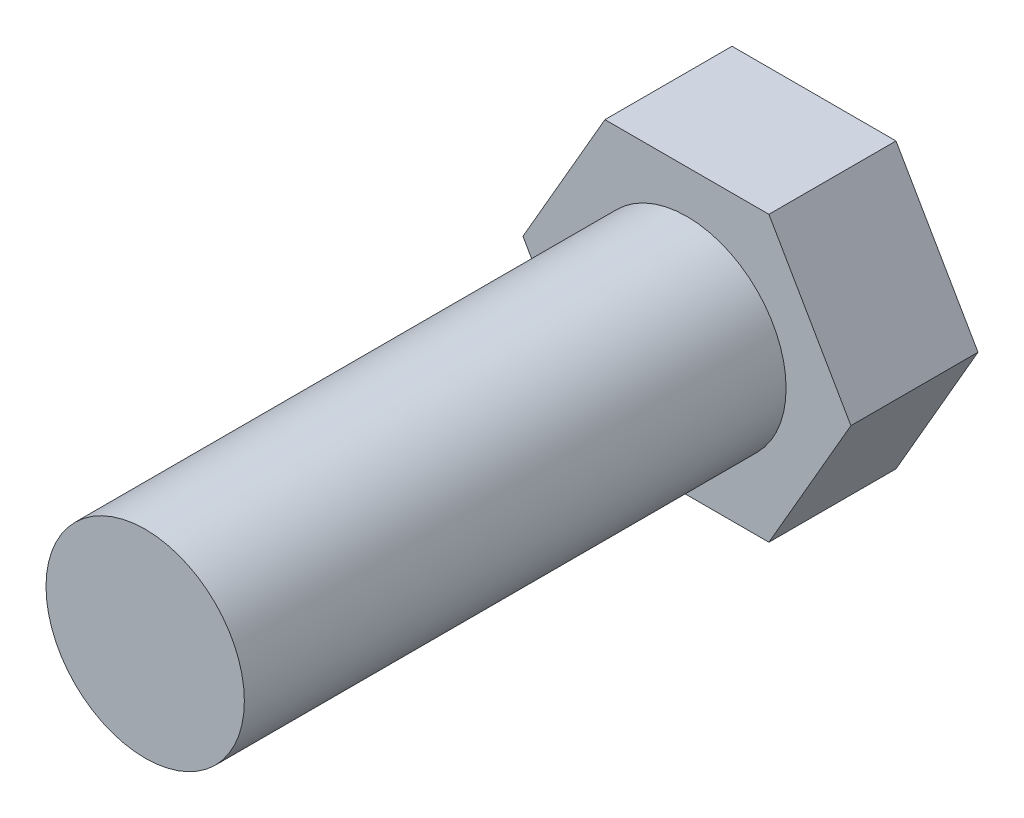
ISO-10303-21;
HEADER;
FILE_DESCRIPTION(('STEP AP214'),'2;1');
FILE_NAME('part.step','',(''),(''),'','','');
FILE_SCHEMA(('AUTOMOTIVE_DESIGN { 1 0 10303 214 1 1 1 1 }'));
ENDSEC;
DATA;
#1=APPLICATION_CONTEXT('core data for automotive mechanical design processes');
#2=APPLICATION_PROTOCOL_DEFINITION('international standard','automotive_design',2000,#1);
#3=PRODUCT_CONTEXT('',#1,'mechanical');
#4=PRODUCT('Part','Part','',(#3));
#5=PRODUCT_RELATED_PRODUCT_CATEGORY('part','',(#4));
#6=PRODUCT_DEFINITION_FORMATION('','',#4);
#7=PRODUCT_DEFINITION_CONTEXT('part definition',#1,'design');
#8=PRODUCT_DEFINITION('design','',#6,#7);
#9=PRODUCT_DEFINITION_SHAPE('','',#8);
#10=(LENGTH_UNIT() NAMED_UNIT(*) SI_UNIT(.MILLI.,.METRE.));
#11=(NAMED_UNIT(*) PLANE_ANGLE_UNIT() SI_UNIT($,.RADIAN.));
#12=(NAMED_UNIT(*) SI_UNIT($,.STERADIAN.) SOLID_ANGLE_UNIT());
#13=UNCERTAINTY_MEASURE_WITH_UNIT(LENGTH_MEASURE(1.E-05),#10,'distance_accuracy_value','');
#14=(GEOMETRIC_REPRESENTATION_CONTEXT(3) GLOBAL_UNCERTAINTY_ASSIGNED_CONTEXT((#13)) GLOBAL_UNIT_ASSIGNED_CONTEXT((#10,
#11,#12)) REPRESENTATION_CONTEXT('',''));
#15=CARTESIAN_POINT('',(0.,0.,0.));
#16=DIRECTION('',(0.,0.,1.));
#17=DIRECTION('',(1.,0.,0.));
#18=AXIS2_PLACEMENT_3D('',#15,#16,#17);
#19=CARTESIAN_POINT('',(-1.9675,-3.40780996389176,3.05));
#20=DIRECTION('',(0.,1.,0.));
#21=DIRECTION('',(-1.,0.,0.));
#22=AXIS2_PLACEMENT_3D('',#19,#20,#21);
#23=PLANE('',#22);
#24=DIRECTION('',(1.,0.,0.));
#25=VECTOR('',#24,1.);
#26=CARTESIAN_POINT('',(-1.9675,-3.40780996389176,0.));
#27=LINE('',#26,#25);
#28=CARTESIAN_POINT('',(-1.9675,-3.40780996389176,0.));
#29=VERTEX_POINT('',#28);
#30=CARTESIAN_POINT('',(1.9675,-3.40780996389177,0.));
#31=VERTEX_POINT('',#30);
#32=EDGE_CURVE('E127',#29,#31,#27,.T.);
#33=ORIENTED_EDGE('',*,*,#32,.T.);
#34=DIRECTION('',(0.,0.,-1.));
#35=VECTOR('',#34,1.);
#36=CARTESIAN_POINT('',(1.9675,-3.40780996389177,3.05));
#37=LINE('',#36,#35);
#38=CARTESIAN_POINT('',(1.9675,-3.40780996389177,3.05));
#39=VERTEX_POINT('',#38);
#40=EDGE_CURVE('E44',#39,#31,#37,.T.);
#41=ORIENTED_EDGE('',*,*,#40,.F.);
#42=DIRECTION('',(1.,0.,0.));
#43=VECTOR('',#42,1.);
#44=CARTESIAN_POINT('',(-1.9675,-3.40780996389176,3.05));
#45=LINE('',#44,#43);
#46=CARTESIAN_POINT('',(-1.9675,-3.40780996389176,3.05));
#47=VERTEX_POINT('',#46);
#48=EDGE_CURVE('E138',#47,#39,#45,.T.);
#49=ORIENTED_EDGE('',*,*,#48,.F.);
#50=DIRECTION('',(0.,0.,-1.));
#51=VECTOR('',#50,1.);
#52=CARTESIAN_POINT('',(-1.9675,-3.40780996389176,3.05));
#53=LINE('',#52,#51);
#54=EDGE_CURVE('E123',#47,#29,#53,.T.);
#55=ORIENTED_EDGE('',*,*,#54,.T.);
#56=EDGE_LOOP('',(#33,#41,#49,#55));
#57=FACE_BOUND('',#56,.T.);
#58=ADVANCED_FACE('F41',(#57),#23,.F.);
#59=CARTESIAN_POINT('',(1.9675,-3.40780996389177,3.05));
#60=DIRECTION('',(-0.866025403784439,0.5,0.));
#61=DIRECTION('',(-0.5,-0.866025403784439,0.));
#62=AXIS2_PLACEMENT_3D('',#59,#60,#61);
#63=PLANE('',#62);
#64=DIRECTION('',(0.5,0.866025403784439,0.));
#65=VECTOR('',#64,1.);
#66=CARTESIAN_POINT('',(1.9675,-3.40780996389177,0.));
#67=LINE('',#66,#65);
#68=CARTESIAN_POINT('',(3.935,0.,0.));
#69=VERTEX_POINT('',#68);
#70=EDGE_CURVE('E130',#31,#69,#67,.T.);
#71=ORIENTED_EDGE('',*,*,#70,.T.);
#72=DIRECTION('',(0.,0.,-1.));
#73=VECTOR('',#72,1.);
#74=CARTESIAN_POINT('',(3.935,0.,3.05));
#75=LINE('',#74,#73);
#76=CARTESIAN_POINT('',(3.935,0.,3.05));
#77=VERTEX_POINT('',#76);
#78=EDGE_CURVE('E141',#77,#69,#75,.T.);
#79=ORIENTED_EDGE('',*,*,#78,.F.);
#80=DIRECTION('',(0.5,0.866025403784439,0.));
#81=VECTOR('',#80,1.);
#82=CARTESIAN_POINT('',(1.9675,-3.40780996389177,3.05));
#83=LINE('',#82,#81);
#84=EDGE_CURVE('E96',#39,#77,#83,.T.);
#85=ORIENTED_EDGE('',*,*,#84,.F.);
#86=ORIENTED_EDGE('',*,*,#40,.T.);
#87=EDGE_LOOP('',(#71,#79,#85,#86));
#88=FACE_BOUND('',#87,.T.);
#89=ADVANCED_FACE('F146',(#88),#63,.F.);
#90=CARTESIAN_POINT('',(3.935,0.,3.05));
#91=DIRECTION('',(-0.866025403784438,-0.5,0.));
#92=DIRECTION('',(0.5,-0.866025403784439,0.));
#93=AXIS2_PLACEMENT_3D('',#90,#91,#92);
#94=PLANE('',#93);
#95=DIRECTION('',(-0.5,0.866025403784438,0.));
#96=VECTOR('',#95,1.);
#97=CARTESIAN_POINT('',(3.935,0.,0.));
#98=LINE('',#97,#96);
#99=CARTESIAN_POINT('',(1.9675,3.40780996389177,0.));
#100=VERTEX_POINT('',#99);
#101=EDGE_CURVE('E133',#69,#100,#98,.T.);
#102=ORIENTED_EDGE('',*,*,#101,.T.);
#103=DIRECTION('',(0.,0.,-1.));
#104=VECTOR('',#103,1.);
#105=CARTESIAN_POINT('',(1.9675,3.40780996389177,3.05));
#106=LINE('',#105,#104);
#107=CARTESIAN_POINT('',(1.9675,3.40780996389177,3.05));
#108=VERTEX_POINT('',#107);
#109=EDGE_CURVE('E118',#108,#100,#106,.T.);
#110=ORIENTED_EDGE('',*,*,#109,.F.);
#111=DIRECTION('',(-0.5,0.866025403784438,0.));
#112=VECTOR('',#111,1.);
#113=CARTESIAN_POINT('',(3.935,0.,3.05));
#114=LINE('',#113,#112);
#115=EDGE_CURVE('E109',#77,#108,#114,.T.);
#116=ORIENTED_EDGE('',*,*,#115,.F.);
#117=ORIENTED_EDGE('',*,*,#78,.T.);
#118=EDGE_LOOP('',(#102,#110,#116,#117));
#119=FACE_BOUND('',#118,.T.);
#120=ADVANCED_FACE('F152',(#119),#94,.F.);
#121=CARTESIAN_POINT('',(1.9675,3.40780996389177,3.05));
#122=DIRECTION('',(0.,-1.,0.));
#123=DIRECTION('',(1.,0.,0.));
#124=AXIS2_PLACEMENT_3D('',#121,#122,#123);
#125=PLANE('',#124);
#126=DIRECTION('',(-1.,0.,0.));
#127=VECTOR('',#126,1.);
#128=CARTESIAN_POINT('',(1.9675,3.40780996389177,0.));
#129=LINE('',#128,#127);
#130=CARTESIAN_POINT('',(-1.9675,3.40780996389177,0.));
#131=VERTEX_POINT('',#130);
#132=EDGE_CURVE('E117',#100,#131,#129,.T.);
#133=ORIENTED_EDGE('',*,*,#132,.T.);
#134=DIRECTION('',(0.,0.,-1.));
#135=VECTOR('',#134,1.);
#136=CARTESIAN_POINT('',(-1.9675,3.40780996389177,3.05));
#137=LINE('',#136,#135);
#138=CARTESIAN_POINT('',(-1.9675,3.40780996389177,3.05));
#139=VERTEX_POINT('',#138);
#140=EDGE_CURVE('E114',#139,#131,#137,.T.);
#141=ORIENTED_EDGE('',*,*,#140,.F.);
#142=DIRECTION('',(-1.,0.,0.));
#143=VECTOR('',#142,1.);
#144=CARTESIAN_POINT('',(1.9675,3.40780996389177,3.05));
#145=LINE('',#144,#143);
#146=EDGE_CURVE('E103',#108,#139,#145,.T.);
#147=ORIENTED_EDGE('',*,*,#146,.F.);
#148=ORIENTED_EDGE('',*,*,#109,.T.);
#149=EDGE_LOOP('',(#133,#141,#147,#148));
#150=FACE_BOUND('',#149,.T.);
#151=ADVANCED_FACE('F115',(#150),#125,.F.);
#152=CARTESIAN_POINT('',(-1.9675,3.40780996389177,3.05));
#153=DIRECTION('',(0.866025403784439,-0.5,0.));
#154=DIRECTION('',(0.5,0.866025403784439,0.));
#155=AXIS2_PLACEMENT_3D('',#152,#153,#154);
#156=PLANE('',#155);
#157=DIRECTION('',(-0.5,-0.866025403784439,0.));
#158=VECTOR('',#157,1.);
#159=CARTESIAN_POINT('',(-1.9675,3.40780996389177,0.));
#160=LINE('',#159,#158);
#161=CARTESIAN_POINT('',(-3.935,0.,0.));
#162=VERTEX_POINT('',#161);
#163=EDGE_CURVE('E81',#131,#162,#160,.T.);
#164=ORIENTED_EDGE('',*,*,#163,.T.);
#165=DIRECTION('',(0.,0.,-1.));
#166=VECTOR('',#165,1.);
#167=CARTESIAN_POINT('',(-3.935,0.,3.05));
#168=LINE('',#167,#166);
#169=CARTESIAN_POINT('',(-3.935,0.,3.05));
#170=VERTEX_POINT('',#169);
#171=EDGE_CURVE('E119',#170,#162,#168,.T.);
#172=ORIENTED_EDGE('',*,*,#171,.F.);
#173=DIRECTION('',(-0.5,-0.866025403784439,0.));
#174=VECTOR('',#173,1.);
#175=CARTESIAN_POINT('',(-1.9675,3.40780996389177,3.05));
#176=LINE('',#175,#174);
#177=EDGE_CURVE('E107',#139,#170,#176,.T.);
#178=ORIENTED_EDGE('',*,*,#177,.F.);
#179=ORIENTED_EDGE('',*,*,#140,.T.);
#180=EDGE_LOOP('',(#164,#172,#178,#179));
#181=FACE_BOUND('',#180,.T.);
#182=ADVANCED_FACE('F121',(#181),#156,.F.);
#183=CARTESIAN_POINT('',(-3.935,0.,3.05));
#184=DIRECTION('',(0.866025403784439,0.5,0.));
#185=DIRECTION('',(-0.5,0.866025403784439,0.));
#186=AXIS2_PLACEMENT_3D('',#183,#184,#185);
#187=PLANE('',#186);
#188=DIRECTION('',(0.5,-0.866025403784439,0.));
#189=VECTOR('',#188,1.);
#190=CARTESIAN_POINT('',(-3.935,0.,0.));
#191=LINE('',#190,#189);
#192=EDGE_CURVE('E87',#162,#29,#191,.T.);
#193=ORIENTED_EDGE('',*,*,#192,.T.);
#194=ORIENTED_EDGE('',*,*,#54,.F.);
#195=DIRECTION('',(0.5,-0.866025403784439,0.));
#196=VECTOR('',#195,1.);
#197=CARTESIAN_POINT('',(-3.935,0.,3.05));
#198=LINE('',#197,#196);
#199=EDGE_CURVE('E58',#170,#47,#198,.T.);
#200=ORIENTED_EDGE('',*,*,#199,.F.);
#201=ORIENTED_EDGE('',*,*,#171,.T.);
#202=EDGE_LOOP('',(#193,#194,#200,#201));
#203=FACE_BOUND('',#202,.T.);
#204=ADVANCED_FACE('F168',(#203),#187,.F.);
#205=CARTESIAN_POINT('',(0.,0.,3.05));
#206=DIRECTION('',(0.,0.,1.));
#207=DIRECTION('',(1.,0.,0.));
#208=AXIS2_PLACEMENT_3D('',#205,#206,#207);
#209=PLANE('',#208);
#210=CARTESIAN_POINT('',(0.,0.,3.05));
#211=DIRECTION('',(0.,0.,1.));
#212=DIRECTION('',(1.,0.,0.));
#213=AXIS2_PLACEMENT_3D('',#210,#211,#212);
#214=CIRCLE('',#213,2.38);
#215=CARTESIAN_POINT('',(2.38,0.,3.05));
#216=VERTEX_POINT('',#215);
#217=EDGE_CURVE('E11',#216,#216,#214,.T.);
#218=ORIENTED_EDGE('',*,*,#217,.F.);
#219=EDGE_LOOP('',(#218));
#220=FACE_BOUND('',#219,.T.);
#221=ORIENTED_EDGE('',*,*,#48,.T.);
#222=ORIENTED_EDGE('',*,*,#84,.T.);
#223=ORIENTED_EDGE('',*,*,#115,.T.);
#224=ORIENTED_EDGE('',*,*,#146,.T.);
#225=ORIENTED_EDGE('',*,*,#177,.T.);
#226=ORIENTED_EDGE('',*,*,#199,.T.);
#227=EDGE_LOOP('',(#221,#222,#223,#224,#225,#226));
#228=FACE_BOUND('',#227,.T.);
#229=ADVANCED_FACE('F105',(#220,#228),#209,.T.);
#230=CARTESIAN_POINT('',(0.,0.,0.));
#231=DIRECTION('',(0.,0.,1.));
#232=DIRECTION('',(1.,0.,0.));
#233=AXIS2_PLACEMENT_3D('',#230,#231,#232);
#234=PLANE('',#233);
#235=ORIENTED_EDGE('',*,*,#32,.F.);
#236=ORIENTED_EDGE('',*,*,#192,.F.);
#237=ORIENTED_EDGE('',*,*,#163,.F.);
#238=ORIENTED_EDGE('',*,*,#132,.F.);
#239=ORIENTED_EDGE('',*,*,#101,.F.);
#240=ORIENTED_EDGE('',*,*,#70,.F.);
#241=EDGE_LOOP('',(#235,#236,#237,#238,#239,#240));
#242=FACE_BOUND('',#241,.T.);
#243=ADVANCED_FACE('F151',(#242),#234,.F.);
#244=CARTESIAN_POINT('',(0.,0.,16.05));
#245=DIRECTION('',(0.,0.,-1.));
#246=DIRECTION('',(-1.,0.,0.));
#247=AXIS2_PLACEMENT_3D('',#244,#245,#246);
#248=CYLINDRICAL_SURFACE('',#247,2.38);
#249=CARTESIAN_POINT('',(0.,0.,16.05));
#250=DIRECTION('',(0.,0.,1.));
#251=DIRECTION('',(1.,0.,0.));
#252=AXIS2_PLACEMENT_3D('',#249,#250,#251);
#253=CIRCLE('',#252,2.38);
#254=CARTESIAN_POINT('',(2.38,0.,16.05));
#255=VERTEX_POINT('',#254);
#256=EDGE_CURVE('E131',#255,#255,#253,.T.);
#257=ORIENTED_EDGE('',*,*,#256,.F.);
#258=EDGE_LOOP('',(#257));
#259=FACE_BOUND('',#258,.T.);
#260=ORIENTED_EDGE('',*,*,#217,.T.);
#261=EDGE_LOOP('',(#260));
#262=FACE_BOUND('',#261,.T.);
#263=ADVANCED_FACE('F161',(#259,#262),#248,.T.);
#264=CARTESIAN_POINT('',(0.,0.,16.05));
#265=DIRECTION('',(0.,0.,1.));
#266=DIRECTION('',(1.,0.,0.));
#267=AXIS2_PLACEMENT_3D('',#264,#265,#266);
#268=PLANE('',#267);
#269=ORIENTED_EDGE('',*,*,#256,.T.);
#270=EDGE_LOOP('',(#269));
#271=FACE_BOUND('',#270,.T.);
#272=ADVANCED_FACE('F159',(#271),#268,.T.);
#273=CLOSED_SHELL('',(#58,#89,#120,#151,#182,#204,#229,#243,#263,#272));
#274=MANIFOLD_SOLID_BREP('B2',#273);
#275=ADVANCED_BREP_SHAPE_REPRESENTATION('',(#18,#274),#14);
#276=SHAPE_DEFINITION_REPRESENTATION(#9,#275);
ENDSEC;
END-ISO-10303-21;
